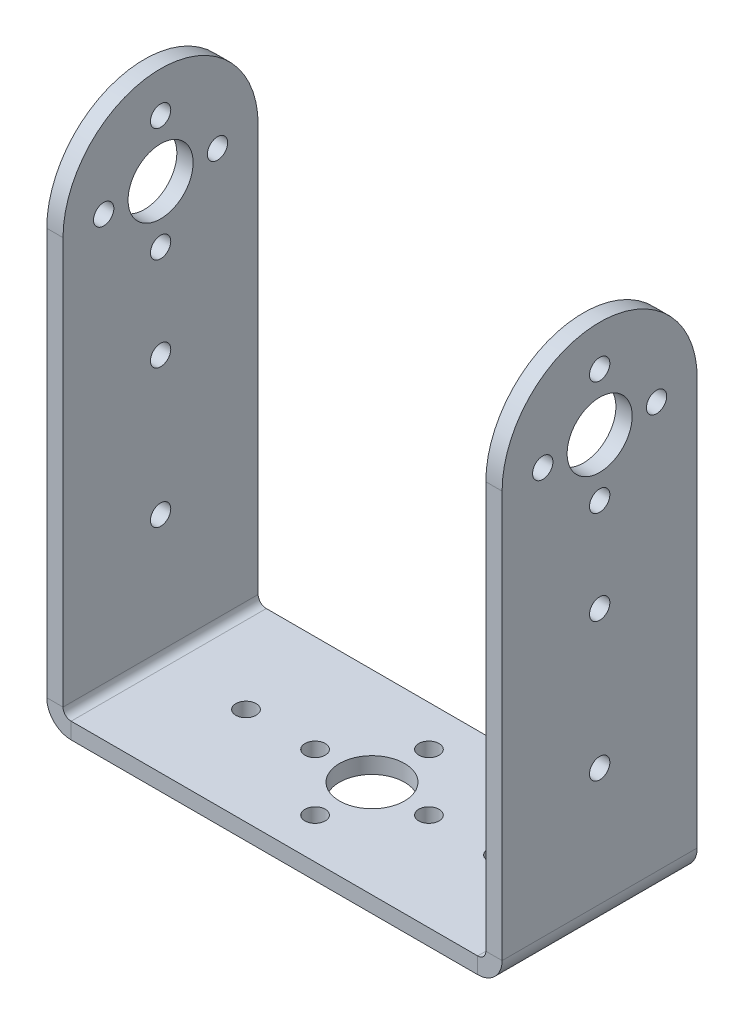
ISO-10303-21;
HEADER;
FILE_DESCRIPTION(('STEP AP214'),'2;1');
FILE_NAME('part.step','',(''),(''),'','','');
FILE_SCHEMA(('AUTOMOTIVE_DESIGN { 1 0 10303 214 1 1 1 1 }'));
ENDSEC;
DATA;
#1=APPLICATION_CONTEXT('core data for automotive mechanical design processes');
#2=APPLICATION_PROTOCOL_DEFINITION('international standard','automotive_design',2000,#1);
#3=PRODUCT_CONTEXT('',#1,'mechanical');
#4=PRODUCT('Part','Part','',(#3));
#5=PRODUCT_RELATED_PRODUCT_CATEGORY('part','',(#4));
#6=PRODUCT_DEFINITION_FORMATION('','',#4);
#7=PRODUCT_DEFINITION_CONTEXT('part definition',#1,'design');
#8=PRODUCT_DEFINITION('design','',#6,#7);
#9=PRODUCT_DEFINITION_SHAPE('','',#8);
#10=(LENGTH_UNIT() NAMED_UNIT(*) SI_UNIT(.MILLI.,.METRE.));
#11=(NAMED_UNIT(*) PLANE_ANGLE_UNIT() SI_UNIT($,.RADIAN.));
#12=(NAMED_UNIT(*) SI_UNIT($,.STERADIAN.) SOLID_ANGLE_UNIT());
#13=UNCERTAINTY_MEASURE_WITH_UNIT(LENGTH_MEASURE(1.E-05),#10,'distance_accuracy_value','');
#14=(GEOMETRIC_REPRESENTATION_CONTEXT(3) GLOBAL_UNCERTAINTY_ASSIGNED_CONTEXT((#13)) GLOBAL_UNIT_ASSIGNED_CONTEXT((#10,
#11,#12)) REPRESENTATION_CONTEXT('',''));
#15=CARTESIAN_POINT('',(0.,0.,0.));
#16=DIRECTION('',(0.,0.,1.));
#17=DIRECTION('',(1.,0.,0.));
#18=AXIS2_PLACEMENT_3D('',#15,#16,#17);
#19=CARTESIAN_POINT('',(28.,0.,12.));
#20=DIRECTION('',(-1.,0.,0.));
#21=DIRECTION('',(0.,-1.,0.));
#22=AXIS2_PLACEMENT_3D('',#19,#20,#21);
#23=PLANE('',#22);
#24=CARTESIAN_POINT('',(28.,60.,0.));
#25=DIRECTION('',(1.,0.,0.));
#26=DIRECTION('',(0.,0.,-1.));
#27=AXIS2_PLACEMENT_3D('',#24,#25,#26);
#28=CIRCLE('',#27,1.25);
#29=CARTESIAN_POINT('',(28.,60.,-1.25));
#30=VERTEX_POINT('',#29);
#31=EDGE_CURVE('E778',#30,#30,#28,.T.);
#32=ORIENTED_EDGE('',*,*,#31,.F.);
#33=EDGE_LOOP('',(#32));
#34=FACE_BOUND('',#33,.T.);
#35=CARTESIAN_POINT('',(28.,53.,-7.));
#36=DIRECTION('',(1.,0.,0.));
#37=DIRECTION('',(0.,0.,-1.));
#38=AXIS2_PLACEMENT_3D('',#35,#36,#37);
#39=CIRCLE('',#38,1.25);
#40=CARTESIAN_POINT('',(28.,53.,-8.25));
#41=VERTEX_POINT('',#40);
#42=EDGE_CURVE('E789',#41,#41,#39,.T.);
#43=ORIENTED_EDGE('',*,*,#42,.F.);
#44=EDGE_LOOP('',(#43));
#45=FACE_BOUND('',#44,.T.);
#46=CARTESIAN_POINT('',(28.,46.,0.));
#47=DIRECTION('',(1.,0.,0.));
#48=DIRECTION('',(0.,0.,-1.));
#49=AXIS2_PLACEMENT_3D('',#46,#47,#48);
#50=CIRCLE('',#49,1.25);
#51=CARTESIAN_POINT('',(28.,46.,-1.25));
#52=VERTEX_POINT('',#51);
#53=EDGE_CURVE('E801',#52,#52,#50,.T.);
#54=ORIENTED_EDGE('',*,*,#53,.F.);
#55=EDGE_LOOP('',(#54));
#56=FACE_BOUND('',#55,.T.);
#57=CARTESIAN_POINT('',(28.,34.5,0.));
#58=DIRECTION('',(1.,0.,0.));
#59=DIRECTION('',(0.,0.,-1.));
#60=AXIS2_PLACEMENT_3D('',#57,#58,#59);
#61=CIRCLE('',#60,1.25);
#62=CARTESIAN_POINT('',(28.,34.5,-1.25));
#63=VERTEX_POINT('',#62);
#64=EDGE_CURVE('E825',#63,#63,#61,.T.);
#65=ORIENTED_EDGE('',*,*,#64,.F.);
#66=EDGE_LOOP('',(#65));
#67=FACE_BOUND('',#66,.T.);
#68=CARTESIAN_POINT('',(28.,17.5,0.));
#69=DIRECTION('',(1.,0.,0.));
#70=DIRECTION('',(0.,0.,-1.));
#71=AXIS2_PLACEMENT_3D('',#68,#69,#70);
#72=CIRCLE('',#71,1.25);
#73=CARTESIAN_POINT('',(28.,17.5,-1.25));
#74=VERTEX_POINT('',#73);
#75=EDGE_CURVE('E837',#74,#74,#72,.T.);
#76=ORIENTED_EDGE('',*,*,#75,.F.);
#77=EDGE_LOOP('',(#76));
#78=FACE_BOUND('',#77,.T.);
#79=CARTESIAN_POINT('',(28.,53.,0.));
#80=DIRECTION('',(1.,0.,0.));
#81=DIRECTION('',(0.,0.,-1.));
#82=AXIS2_PLACEMENT_3D('',#79,#80,#81);
#83=CIRCLE('',#82,4.);
#84=CARTESIAN_POINT('',(28.,53.,-4.));
#85=VERTEX_POINT('',#84);
#86=EDGE_CURVE('E849',#85,#85,#83,.T.);
#87=ORIENTED_EDGE('',*,*,#86,.F.);
#88=EDGE_LOOP('',(#87));
#89=FACE_BOUND('',#88,.T.);
#90=DIRECTION('',(0.,1.,0.));
#91=VECTOR('',#90,1.);
#92=CARTESIAN_POINT('',(28.,0.,-12.));
#93=LINE('',#92,#91);
#94=CARTESIAN_POINT('',(28.,3.,-12.));
#95=VERTEX_POINT('',#94);
#96=CARTESIAN_POINT('',(28.,53.,-12.));
#97=VERTEX_POINT('',#96);
#98=EDGE_CURVE('E163',#95,#97,#93,.T.);
#99=ORIENTED_EDGE('',*,*,#98,.T.);
#100=CARTESIAN_POINT('',(28.,53.,0.));
#101=DIRECTION('',(-1.,0.,0.));
#102=DIRECTION('',(0.,-1.,0.));
#103=AXIS2_PLACEMENT_3D('',#100,#101,#102);
#104=CIRCLE('',#103,12.);
#105=CARTESIAN_POINT('',(28.,53.,12.));
#106=VERTEX_POINT('',#105);
#107=EDGE_CURVE('E256',#97,#106,#104,.F.);
#108=ORIENTED_EDGE('',*,*,#107,.T.);
#109=DIRECTION('',(0.,1.,0.));
#110=VECTOR('',#109,1.);
#111=CARTESIAN_POINT('',(28.,0.,12.));
#112=LINE('',#111,#110);
#113=CARTESIAN_POINT('',(28.,3.,12.));
#114=VERTEX_POINT('',#113);
#115=EDGE_CURVE('E188',#114,#106,#112,.T.);
#116=ORIENTED_EDGE('',*,*,#115,.F.);
#117=DIRECTION('',(0.,0.,-1.));
#118=VECTOR('',#117,1.);
#119=CARTESIAN_POINT('',(28.,3.,12.));
#120=LINE('',#119,#118);
#121=EDGE_CURVE('E162',#114,#95,#120,.T.);
#122=ORIENTED_EDGE('',*,*,#121,.T.);
#123=EDGE_LOOP('',(#99,#108,#116,#122));
#124=FACE_BOUND('',#123,.T.);
#125=CARTESIAN_POINT('',(28.,53.,7.));
#126=DIRECTION('',(1.,0.,0.));
#127=DIRECTION('',(0.,0.,-1.));
#128=AXIS2_PLACEMENT_3D('',#125,#126,#127);
#129=CIRCLE('',#128,1.25);
#130=CARTESIAN_POINT('',(28.,53.,5.75));
#131=VERTEX_POINT('',#130);
#132=EDGE_CURVE('E813',#131,#131,#129,.T.);
#133=ORIENTED_EDGE('',*,*,#132,.F.);
#134=EDGE_LOOP('',(#133));
#135=FACE_BOUND('',#134,.T.);
#136=ADVANCED_FACE('F39',(#34,#45,#56,#67,#78,#89,#124,#135),#23,.F.);
#137=CARTESIAN_POINT('',(26.,0.,12.));
#138=DIRECTION('',(-1.,0.,0.));
#139=DIRECTION('',(0.,-1.,0.));
#140=AXIS2_PLACEMENT_3D('',#137,#138,#139);
#141=PLANE('',#140);
#142=CARTESIAN_POINT('',(26.,60.,0.));
#143=DIRECTION('',(-1.,0.,0.));
#144=DIRECTION('',(0.,-1.,0.));
#145=AXIS2_PLACEMENT_3D('',#142,#143,#144);
#146=CIRCLE('',#145,1.25);
#147=CARTESIAN_POINT('',(26.,58.75,0.));
#148=VERTEX_POINT('',#147);
#149=EDGE_CURVE('E786',#148,#148,#146,.T.);
#150=ORIENTED_EDGE('',*,*,#149,.F.);
#151=EDGE_LOOP('',(#150));
#152=FACE_BOUND('',#151,.T.);
#153=CARTESIAN_POINT('',(26.,53.,-7.));
#154=DIRECTION('',(-1.,0.,0.));
#155=DIRECTION('',(0.,-1.,0.));
#156=AXIS2_PLACEMENT_3D('',#153,#154,#155);
#157=CIRCLE('',#156,1.25);
#158=CARTESIAN_POINT('',(26.,51.75,-7.));
#159=VERTEX_POINT('',#158);
#160=EDGE_CURVE('E798',#159,#159,#157,.T.);
#161=ORIENTED_EDGE('',*,*,#160,.F.);
#162=EDGE_LOOP('',(#161));
#163=FACE_BOUND('',#162,.T.);
#164=CARTESIAN_POINT('',(26.,46.,0.));
#165=DIRECTION('',(-1.,0.,0.));
#166=DIRECTION('',(0.,-1.,0.));
#167=AXIS2_PLACEMENT_3D('',#164,#165,#166);
#168=CIRCLE('',#167,1.25);
#169=CARTESIAN_POINT('',(26.,44.75,0.));
#170=VERTEX_POINT('',#169);
#171=EDGE_CURVE('E810',#170,#170,#168,.T.);
#172=ORIENTED_EDGE('',*,*,#171,.F.);
#173=EDGE_LOOP('',(#172));
#174=FACE_BOUND('',#173,.T.);
#175=CARTESIAN_POINT('',(26.,53.,7.));
#176=DIRECTION('',(-1.,0.,0.));
#177=DIRECTION('',(0.,-1.,0.));
#178=AXIS2_PLACEMENT_3D('',#175,#176,#177);
#179=CIRCLE('',#178,1.25);
#180=CARTESIAN_POINT('',(26.,51.75,7.));
#181=VERTEX_POINT('',#180);
#182=EDGE_CURVE('E822',#181,#181,#179,.T.);
#183=ORIENTED_EDGE('',*,*,#182,.F.);
#184=EDGE_LOOP('',(#183));
#185=FACE_BOUND('',#184,.T.);
#186=CARTESIAN_POINT('',(26.,34.5,0.));
#187=DIRECTION('',(-1.,0.,0.));
#188=DIRECTION('',(0.,-1.,0.));
#189=AXIS2_PLACEMENT_3D('',#186,#187,#188);
#190=CIRCLE('',#189,1.25);
#191=CARTESIAN_POINT('',(26.,33.25,0.));
#192=VERTEX_POINT('',#191);
#193=EDGE_CURVE('E834',#192,#192,#190,.T.);
#194=ORIENTED_EDGE('',*,*,#193,.F.);
#195=EDGE_LOOP('',(#194));
#196=FACE_BOUND('',#195,.T.);
#197=CARTESIAN_POINT('',(26.,17.5,0.));
#198=DIRECTION('',(-1.,0.,0.));
#199=DIRECTION('',(0.,-1.,0.));
#200=AXIS2_PLACEMENT_3D('',#197,#198,#199);
#201=CIRCLE('',#200,1.25);
#202=CARTESIAN_POINT('',(26.,16.25,0.));
#203=VERTEX_POINT('',#202);
#204=EDGE_CURVE('E843',#203,#203,#201,.T.);
#205=ORIENTED_EDGE('',*,*,#204,.F.);
#206=EDGE_LOOP('',(#205));
#207=FACE_BOUND('',#206,.T.);
#208=CARTESIAN_POINT('',(26.,53.,0.));
#209=DIRECTION('',(-1.,0.,0.));
#210=DIRECTION('',(0.,-1.,0.));
#211=AXIS2_PLACEMENT_3D('',#208,#209,#210);
#212=CIRCLE('',#211,4.);
#213=CARTESIAN_POINT('',(26.,49.,0.));
#214=VERTEX_POINT('',#213);
#215=EDGE_CURVE('E254',#214,#214,#212,.T.);
#216=ORIENTED_EDGE('',*,*,#215,.F.);
#217=EDGE_LOOP('',(#216));
#218=FACE_BOUND('',#217,.T.);
#219=CARTESIAN_POINT('',(26.,53.,0.));
#220=DIRECTION('',(-1.,0.,0.));
#221=DIRECTION('',(0.,-1.,0.));
#222=AXIS2_PLACEMENT_3D('',#219,#220,#221);
#223=CIRCLE('',#222,12.);
#224=CARTESIAN_POINT('',(26.,53.,-12.));
#225=VERTEX_POINT('',#224);
#226=CARTESIAN_POINT('',(26.,53.,12.));
#227=VERTEX_POINT('',#226);
#228=EDGE_CURVE('E259',#225,#227,#223,.F.);
#229=ORIENTED_EDGE('',*,*,#228,.F.);
#230=DIRECTION('',(0.,1.,0.));
#231=VECTOR('',#230,1.);
#232=CARTESIAN_POINT('',(26.,0.,-12.));
#233=LINE('',#232,#231);
#234=CARTESIAN_POINT('',(26.,3.,-12.));
#235=VERTEX_POINT('',#234);
#236=EDGE_CURVE('E166',#235,#225,#233,.T.);
#237=ORIENTED_EDGE('',*,*,#236,.F.);
#238=DIRECTION('',(0.,0.,-1.));
#239=VECTOR('',#238,1.);
#240=CARTESIAN_POINT('',(26.,3.,12.));
#241=LINE('',#240,#239);
#242=CARTESIAN_POINT('',(26.,3.,12.));
#243=VERTEX_POINT('',#242);
#244=EDGE_CURVE('E200',#243,#235,#241,.T.);
#245=ORIENTED_EDGE('',*,*,#244,.F.);
#246=DIRECTION('',(0.,1.,0.));
#247=VECTOR('',#246,1.);
#248=CARTESIAN_POINT('',(26.,0.,12.));
#249=LINE('',#248,#247);
#250=EDGE_CURVE('E275',#243,#227,#249,.T.);
#251=ORIENTED_EDGE('',*,*,#250,.T.);
#252=EDGE_LOOP('',(#229,#237,#245,#251));
#253=FACE_BOUND('',#252,.T.);
#254=ADVANCED_FACE('F312',(#152,#163,#174,#185,#196,#207,#218,#253),#141,.T.);
#255=CARTESIAN_POINT('',(-26.,65.,12.));
#256=DIRECTION('',(1.,0.,0.));
#257=DIRECTION('',(0.,1.,0.));
#258=AXIS2_PLACEMENT_3D('',#255,#256,#257);
#259=PLANE('',#258);
#260=CARTESIAN_POINT('',(-26.,60.,0.));
#261=DIRECTION('',(1.,0.,0.));
#262=DIRECTION('',(0.,1.,0.));
#263=AXIS2_PLACEMENT_3D('',#260,#261,#262);
#264=CIRCLE('',#263,1.25);
#265=CARTESIAN_POINT('',(-26.,61.25,0.));
#266=VERTEX_POINT('',#265);
#267=EDGE_CURVE('E783',#266,#266,#264,.T.);
#268=ORIENTED_EDGE('',*,*,#267,.F.);
#269=EDGE_LOOP('',(#268));
#270=FACE_BOUND('',#269,.T.);
#271=CARTESIAN_POINT('',(-26.,53.,-7.));
#272=DIRECTION('',(1.,0.,0.));
#273=DIRECTION('',(0.,1.,0.));
#274=AXIS2_PLACEMENT_3D('',#271,#272,#273);
#275=CIRCLE('',#274,1.25);
#276=CARTESIAN_POINT('',(-26.,54.25,-7.));
#277=VERTEX_POINT('',#276);
#278=EDGE_CURVE('E795',#277,#277,#275,.T.);
#279=ORIENTED_EDGE('',*,*,#278,.F.);
#280=EDGE_LOOP('',(#279));
#281=FACE_BOUND('',#280,.T.);
#282=CARTESIAN_POINT('',(-26.,46.,0.));
#283=DIRECTION('',(1.,0.,0.));
#284=DIRECTION('',(0.,1.,0.));
#285=AXIS2_PLACEMENT_3D('',#282,#283,#284);
#286=CIRCLE('',#285,1.25);
#287=CARTESIAN_POINT('',(-26.,47.25,0.));
#288=VERTEX_POINT('',#287);
#289=EDGE_CURVE('E807',#288,#288,#286,.T.);
#290=ORIENTED_EDGE('',*,*,#289,.F.);
#291=EDGE_LOOP('',(#290));
#292=FACE_BOUND('',#291,.T.);
#293=CARTESIAN_POINT('',(-26.,53.,7.));
#294=DIRECTION('',(1.,0.,0.));
#295=DIRECTION('',(0.,1.,0.));
#296=AXIS2_PLACEMENT_3D('',#293,#294,#295);
#297=CIRCLE('',#296,1.25);
#298=CARTESIAN_POINT('',(-26.,54.25,7.));
#299=VERTEX_POINT('',#298);
#300=EDGE_CURVE('E819',#299,#299,#297,.T.);
#301=ORIENTED_EDGE('',*,*,#300,.F.);
#302=EDGE_LOOP('',(#301));
#303=FACE_BOUND('',#302,.T.);
#304=CARTESIAN_POINT('',(-26.,34.5,0.));
#305=DIRECTION('',(1.,0.,0.));
#306=DIRECTION('',(0.,1.,0.));
#307=AXIS2_PLACEMENT_3D('',#304,#305,#306);
#308=CIRCLE('',#307,1.25);
#309=CARTESIAN_POINT('',(-26.,35.75,0.));
#310=VERTEX_POINT('',#309);
#311=EDGE_CURVE('E831',#310,#310,#308,.T.);
#312=ORIENTED_EDGE('',*,*,#311,.F.);
#313=EDGE_LOOP('',(#312));
#314=FACE_BOUND('',#313,.T.);
#315=CARTESIAN_POINT('',(-26.,17.5,0.));
#316=DIRECTION('',(1.,0.,0.));
#317=DIRECTION('',(0.,1.,0.));
#318=AXIS2_PLACEMENT_3D('',#315,#316,#317);
#319=CIRCLE('',#318,1.25);
#320=CARTESIAN_POINT('',(-26.,18.75,0.));
#321=VERTEX_POINT('',#320);
#322=EDGE_CURVE('E846',#321,#321,#319,.T.);
#323=ORIENTED_EDGE('',*,*,#322,.F.);
#324=EDGE_LOOP('',(#323));
#325=FACE_BOUND('',#324,.T.);
#326=CARTESIAN_POINT('',(-26.,53.,0.));
#327=DIRECTION('',(1.,0.,0.));
#328=DIRECTION('',(0.,1.,0.));
#329=AXIS2_PLACEMENT_3D('',#326,#327,#328);
#330=CIRCLE('',#329,4.);
#331=CARTESIAN_POINT('',(-26.,57.,0.));
#332=VERTEX_POINT('',#331);
#333=EDGE_CURVE('E855',#332,#332,#330,.T.);
#334=ORIENTED_EDGE('',*,*,#333,.F.);
#335=EDGE_LOOP('',(#334));
#336=FACE_BOUND('',#335,.T.);
#337=DIRECTION('',(0.,-1.,0.));
#338=VECTOR('',#337,1.);
#339=CARTESIAN_POINT('',(-26.,65.,-12.));
#340=LINE('',#339,#338);
#341=CARTESIAN_POINT('',(-26.,53.,-12.));
#342=VERTEX_POINT('',#341);
#343=CARTESIAN_POINT('',(-26.,3.,-12.));
#344=VERTEX_POINT('',#343);
#345=EDGE_CURVE('E178',#342,#344,#340,.T.);
#346=ORIENTED_EDGE('',*,*,#345,.F.);
#347=CARTESIAN_POINT('',(-26.,53.,0.));
#348=DIRECTION('',(1.,0.,0.));
#349=DIRECTION('',(0.,1.,0.));
#350=AXIS2_PLACEMENT_3D('',#347,#348,#349);
#351=CIRCLE('',#350,12.);
#352=CARTESIAN_POINT('',(-26.,53.,12.));
#353=VERTEX_POINT('',#352);
#354=EDGE_CURVE('E266',#353,#342,#351,.F.);
#355=ORIENTED_EDGE('',*,*,#354,.F.);
#356=DIRECTION('',(0.,-1.,0.));
#357=VECTOR('',#356,1.);
#358=CARTESIAN_POINT('',(-26.,65.,12.));
#359=LINE('',#358,#357);
#360=CARTESIAN_POINT('',(-26.,3.,12.));
#361=VERTEX_POINT('',#360);
#362=EDGE_CURVE('E157',#353,#361,#359,.T.);
#363=ORIENTED_EDGE('',*,*,#362,.T.);
#364=DIRECTION('',(0.,0.,-1.));
#365=VECTOR('',#364,1.);
#366=CARTESIAN_POINT('',(-26.,3.,12.));
#367=LINE('',#366,#365);
#368=EDGE_CURVE('E193',#361,#344,#367,.T.);
#369=ORIENTED_EDGE('',*,*,#368,.T.);
#370=EDGE_LOOP('',(#346,#355,#363,#369));
#371=FACE_BOUND('',#370,.T.);
#372=ADVANCED_FACE('F283',(#270,#281,#292,#303,#314,#325,#336,#371),#259,.T.);
#373=CARTESIAN_POINT('',(-28.,65.,12.));
#374=DIRECTION('',(1.,0.,0.));
#375=DIRECTION('',(0.,1.,0.));
#376=AXIS2_PLACEMENT_3D('',#373,#374,#375);
#377=PLANE('',#376);
#378=CARTESIAN_POINT('',(-28.,60.,0.));
#379=DIRECTION('',(1.,0.,0.));
#380=DIRECTION('',(0.,0.,-1.));
#381=AXIS2_PLACEMENT_3D('',#378,#379,#380);
#382=CIRCLE('',#381,1.24999999999999);
#383=CARTESIAN_POINT('',(-28.,60.,-1.24999999999999));
#384=VERTEX_POINT('',#383);
#385=EDGE_CURVE('E781',#384,#384,#382,.T.);
#386=ORIENTED_EDGE('',*,*,#385,.T.);
#387=EDGE_LOOP('',(#386));
#388=FACE_BOUND('',#387,.T.);
#389=CARTESIAN_POINT('',(-28.,53.,-7.));
#390=DIRECTION('',(1.,0.,0.));
#391=DIRECTION('',(0.,0.,-1.));
#392=AXIS2_PLACEMENT_3D('',#389,#390,#391);
#393=CIRCLE('',#392,1.24999999999999);
#394=CARTESIAN_POINT('',(-28.,53.,-8.24999999999999));
#395=VERTEX_POINT('',#394);
#396=EDGE_CURVE('E792',#395,#395,#393,.T.);
#397=ORIENTED_EDGE('',*,*,#396,.T.);
#398=EDGE_LOOP('',(#397));
#399=FACE_BOUND('',#398,.T.);
#400=CARTESIAN_POINT('',(-28.,46.,0.));
#401=DIRECTION('',(1.,0.,0.));
#402=DIRECTION('',(0.,0.,-1.));
#403=AXIS2_PLACEMENT_3D('',#400,#401,#402);
#404=CIRCLE('',#403,1.24999999999999);
#405=CARTESIAN_POINT('',(-28.,46.,-1.24999999999999));
#406=VERTEX_POINT('',#405);
#407=EDGE_CURVE('E804',#406,#406,#404,.T.);
#408=ORIENTED_EDGE('',*,*,#407,.T.);
#409=EDGE_LOOP('',(#408));
#410=FACE_BOUND('',#409,.T.);
#411=CARTESIAN_POINT('',(-28.,53.,7.));
#412=DIRECTION('',(1.,0.,0.));
#413=DIRECTION('',(0.,0.,-1.));
#414=AXIS2_PLACEMENT_3D('',#411,#412,#413);
#415=CIRCLE('',#414,1.24999999999999);
#416=CARTESIAN_POINT('',(-28.,53.,5.75000000000001));
#417=VERTEX_POINT('',#416);
#418=EDGE_CURVE('E816',#417,#417,#415,.T.);
#419=ORIENTED_EDGE('',*,*,#418,.T.);
#420=EDGE_LOOP('',(#419));
#421=FACE_BOUND('',#420,.T.);
#422=CARTESIAN_POINT('',(-28.,34.5,0.));
#423=DIRECTION('',(1.,0.,0.));
#424=DIRECTION('',(0.,0.,-1.));
#425=AXIS2_PLACEMENT_3D('',#422,#423,#424);
#426=CIRCLE('',#425,1.24999999999999);
#427=CARTESIAN_POINT('',(-28.,34.5,-1.24999999999999));
#428=VERTEX_POINT('',#427);
#429=EDGE_CURVE('E828',#428,#428,#426,.T.);
#430=ORIENTED_EDGE('',*,*,#429,.T.);
#431=EDGE_LOOP('',(#430));
#432=FACE_BOUND('',#431,.T.);
#433=CARTESIAN_POINT('',(-28.,17.5,0.));
#434=DIRECTION('',(1.,0.,0.));
#435=DIRECTION('',(0.,0.,-1.));
#436=AXIS2_PLACEMENT_3D('',#433,#434,#435);
#437=CIRCLE('',#436,1.24999999999999);
#438=CARTESIAN_POINT('',(-28.,17.5,-1.24999999999999));
#439=VERTEX_POINT('',#438);
#440=EDGE_CURVE('E840',#439,#439,#437,.T.);
#441=ORIENTED_EDGE('',*,*,#440,.T.);
#442=EDGE_LOOP('',(#441));
#443=FACE_BOUND('',#442,.T.);
#444=CARTESIAN_POINT('',(-28.,53.,0.));
#445=DIRECTION('',(1.,0.,0.));
#446=DIRECTION('',(0.,0.,-1.));
#447=AXIS2_PLACEMENT_3D('',#444,#445,#446);
#448=CIRCLE('',#447,4.);
#449=CARTESIAN_POINT('',(-28.,53.,-4.));
#450=VERTEX_POINT('',#449);
#451=EDGE_CURVE('E852',#450,#450,#448,.T.);
#452=ORIENTED_EDGE('',*,*,#451,.T.);
#453=EDGE_LOOP('',(#452));
#454=FACE_BOUND('',#453,.T.);
#455=CARTESIAN_POINT('',(-28.,53.,0.));
#456=DIRECTION('',(1.,0.,0.));
#457=DIRECTION('',(0.,1.,0.));
#458=AXIS2_PLACEMENT_3D('',#455,#456,#457);
#459=CIRCLE('',#458,12.);
#460=CARTESIAN_POINT('',(-28.,53.,12.));
#461=VERTEX_POINT('',#460);
#462=CARTESIAN_POINT('',(-28.,53.,-12.));
#463=VERTEX_POINT('',#462);
#464=EDGE_CURVE('E267',#461,#463,#459,.F.);
#465=ORIENTED_EDGE('',*,*,#464,.T.);
#466=DIRECTION('',(0.,-1.,0.));
#467=VECTOR('',#466,1.);
#468=CARTESIAN_POINT('',(-28.,65.,-12.));
#469=LINE('',#468,#467);
#470=CARTESIAN_POINT('',(-28.,3.,-12.));
#471=VERTEX_POINT('',#470);
#472=EDGE_CURVE('E181',#463,#471,#469,.T.);
#473=ORIENTED_EDGE('',*,*,#472,.T.);
#474=DIRECTION('',(0.,0.,-1.));
#475=VECTOR('',#474,1.);
#476=CARTESIAN_POINT('',(-28.,3.,12.));
#477=LINE('',#476,#475);
#478=CARTESIAN_POINT('',(-28.,3.,12.));
#479=VERTEX_POINT('',#478);
#480=EDGE_CURVE('E136',#479,#471,#477,.T.);
#481=ORIENTED_EDGE('',*,*,#480,.F.);
#482=DIRECTION('',(0.,-1.,0.));
#483=VECTOR('',#482,1.);
#484=CARTESIAN_POINT('',(-28.,65.,12.));
#485=LINE('',#484,#483);
#486=EDGE_CURVE('E155',#461,#479,#485,.T.);
#487=ORIENTED_EDGE('',*,*,#486,.F.);
#488=EDGE_LOOP('',(#465,#473,#481,#487));
#489=FACE_BOUND('',#488,.T.);
#490=ADVANCED_FACE('F302',(#388,#399,#410,#421,#432,#443,#454,#489),#377,.F.);
#491=CARTESIAN_POINT('',(25.,3.,12.));
#492=DIRECTION('',(0.,0.,1.));
#493=DIRECTION('',(1.,0.,0.));
#494=AXIS2_PLACEMENT_3D('',#491,#492,#493);
#495=PLANE('',#494);
#496=ORIENTED_EDGE('',*,*,#115,.T.);
#497=DIRECTION('',(1.,0.,0.));
#498=VECTOR('',#497,1.);
#499=CARTESIAN_POINT('',(28.,53.,12.));
#500=LINE('',#499,#498);
#501=EDGE_CURVE('E54',#106,#227,#500,.F.);
#502=ORIENTED_EDGE('',*,*,#501,.T.);
#503=ORIENTED_EDGE('',*,*,#250,.F.);
#504=DIRECTION('',(1.,0.,0.));
#505=VECTOR('',#504,1.);
#506=CARTESIAN_POINT('',(26.,3.,12.));
#507=LINE('',#506,#505);
#508=EDGE_CURVE('E208',#243,#114,#507,.T.);
#509=ORIENTED_EDGE('',*,*,#508,.T.);
#510=EDGE_LOOP('',(#496,#502,#503,#509));
#511=FACE_BOUND('',#510,.T.);
#512=ADVANCED_FACE('F304',(#511),#495,.T.);
#513=CARTESIAN_POINT('',(-28.,3.,12.));
#514=DIRECTION('',(0.,0.,1.));
#515=DIRECTION('',(1.,0.,0.));
#516=AXIS2_PLACEMENT_3D('',#513,#514,#515);
#517=PLANE('',#516);
#518=DIRECTION('',(1.,0.,0.));
#519=VECTOR('',#518,1.);
#520=CARTESIAN_POINT('',(-28.,3.,12.));
#521=LINE('',#520,#519);
#522=EDGE_CURVE('E11',#479,#361,#521,.T.);
#523=ORIENTED_EDGE('',*,*,#522,.F.);
#524=CARTESIAN_POINT('',(-25.,3.,12.));
#525=DIRECTION('',(0.,0.,-1.));
#526=DIRECTION('',(-1.,0.,0.));
#527=AXIS2_PLACEMENT_3D('',#524,#525,#526);
#528=CIRCLE('',#527,3.);
#529=CARTESIAN_POINT('',(-25.,0.,12.));
#530=VERTEX_POINT('',#529);
#531=EDGE_CURVE('E128',#479,#530,#528,.F.);
#532=ORIENTED_EDGE('',*,*,#531,.T.);
#533=DIRECTION('',(0.,-1.,0.));
#534=VECTOR('',#533,1.);
#535=CARTESIAN_POINT('',(-25.,2.,12.));
#536=LINE('',#535,#534);
#537=CARTESIAN_POINT('',(-25.,2.,12.));
#538=VERTEX_POINT('',#537);
#539=EDGE_CURVE('E47',#538,#530,#536,.T.);
#540=ORIENTED_EDGE('',*,*,#539,.F.);
#541=CARTESIAN_POINT('',(-25.,3.,12.));
#542=DIRECTION('',(0.,0.,1.));
#543=DIRECTION('',(1.,0.,0.));
#544=AXIS2_PLACEMENT_3D('',#541,#542,#543);
#545=CIRCLE('',#544,1.);
#546=EDGE_CURVE('E225',#361,#538,#545,.T.);
#547=ORIENTED_EDGE('',*,*,#546,.F.);
#548=EDGE_LOOP('',(#523,#532,#540,#547));
#549=FACE_BOUND('',#548,.T.);
#550=ADVANCED_FACE('F41',(#549),#517,.T.);
#551=CARTESIAN_POINT('',(-25.,2.,12.));
#552=DIRECTION('',(0.,0.,1.));
#553=DIRECTION('',(1.,0.,0.));
#554=AXIS2_PLACEMENT_3D('',#551,#552,#553);
#555=PLANE('',#554);
#556=DIRECTION('',(1.,0.,0.));
#557=VECTOR('',#556,1.);
#558=CARTESIAN_POINT('',(-26.,53.,12.));
#559=LINE('',#558,#557);
#560=EDGE_CURVE('E167',#353,#461,#559,.F.);
#561=ORIENTED_EDGE('',*,*,#560,.T.);
#562=ORIENTED_EDGE('',*,*,#486,.T.);
#563=ORIENTED_EDGE('',*,*,#522,.T.);
#564=ORIENTED_EDGE('',*,*,#362,.F.);
#565=EDGE_LOOP('',(#561,#562,#563,#564));
#566=FACE_BOUND('',#565,.T.);
#567=ADVANCED_FACE('F285',(#566),#555,.T.);
#568=CARTESIAN_POINT('',(-25.,0.,-12.));
#569=DIRECTION('',(0.,0.,-1.));
#570=DIRECTION('',(-1.,0.,0.));
#571=AXIS2_PLACEMENT_3D('',#568,#569,#570);
#572=PLANE('',#571);
#573=DIRECTION('',(0.,1.,0.));
#574=VECTOR('',#573,1.);
#575=CARTESIAN_POINT('',(-25.,0.,-12.));
#576=LINE('',#575,#574);
#577=CARTESIAN_POINT('',(-25.,0.,-12.));
#578=VERTEX_POINT('',#577);
#579=CARTESIAN_POINT('',(-25.,2.,-12.));
#580=VERTEX_POINT('',#579);
#581=EDGE_CURVE('E153',#578,#580,#576,.T.);
#582=ORIENTED_EDGE('',*,*,#581,.F.);
#583=CARTESIAN_POINT('',(-25.,3.,-12.));
#584=DIRECTION('',(0.,0.,-1.));
#585=DIRECTION('',(-1.,0.,0.));
#586=AXIS2_PLACEMENT_3D('',#583,#584,#585);
#587=CIRCLE('',#586,3.);
#588=EDGE_CURVE('E131',#471,#578,#587,.F.);
#589=ORIENTED_EDGE('',*,*,#588,.F.);
#590=DIRECTION('',(-1.,0.,0.));
#591=VECTOR('',#590,1.);
#592=CARTESIAN_POINT('',(-26.,3.,-12.));
#593=LINE('',#592,#591);
#594=EDGE_CURVE('E212',#344,#471,#593,.T.);
#595=ORIENTED_EDGE('',*,*,#594,.F.);
#596=CARTESIAN_POINT('',(-25.,3.,-12.));
#597=DIRECTION('',(0.,0.,1.));
#598=DIRECTION('',(1.,0.,0.));
#599=AXIS2_PLACEMENT_3D('',#596,#597,#598);
#600=CIRCLE('',#599,1.);
#601=EDGE_CURVE('E175',#344,#580,#600,.T.);
#602=ORIENTED_EDGE('',*,*,#601,.T.);
#603=EDGE_LOOP('',(#582,#589,#595,#602));
#604=FACE_BOUND('',#603,.T.);
#605=ADVANCED_FACE('F219',(#604),#572,.T.);
#606=CARTESIAN_POINT('',(-26.,3.,-12.));
#607=DIRECTION('',(0.,0.,-1.));
#608=DIRECTION('',(-1.,0.,0.));
#609=AXIS2_PLACEMENT_3D('',#606,#607,#608);
#610=PLANE('',#609);
#611=DIRECTION('',(1.,0.,0.));
#612=VECTOR('',#611,1.);
#613=CARTESIAN_POINT('',(-28.,0.,-12.));
#614=LINE('',#613,#612);
#615=CARTESIAN_POINT('',(25.,0.,-12.));
#616=VERTEX_POINT('',#615);
#617=EDGE_CURVE('E185',#578,#616,#614,.T.);
#618=ORIENTED_EDGE('',*,*,#617,.F.);
#619=ORIENTED_EDGE('',*,*,#581,.T.);
#620=DIRECTION('',(1.,0.,0.));
#621=VECTOR('',#620,1.);
#622=CARTESIAN_POINT('',(-28.,2.,-12.));
#623=LINE('',#622,#621);
#624=CARTESIAN_POINT('',(25.,2.,-12.));
#625=VERTEX_POINT('',#624);
#626=EDGE_CURVE('E172',#580,#625,#623,.T.);
#627=ORIENTED_EDGE('',*,*,#626,.T.);
#628=DIRECTION('',(0.,-1.,0.));
#629=VECTOR('',#628,1.);
#630=CARTESIAN_POINT('',(25.,2.,-12.));
#631=LINE('',#630,#629);
#632=EDGE_CURVE('E202',#625,#616,#631,.T.);
#633=ORIENTED_EDGE('',*,*,#632,.T.);
#634=EDGE_LOOP('',(#618,#619,#627,#633));
#635=FACE_BOUND('',#634,.T.);
#636=ADVANCED_FACE('F216',(#635),#610,.T.);
#637=CARTESIAN_POINT('',(25.,0.,12.));
#638=DIRECTION('',(0.,0.,1.));
#639=DIRECTION('',(1.,0.,0.));
#640=AXIS2_PLACEMENT_3D('',#637,#638,#639);
#641=PLANE('',#640);
#642=DIRECTION('',(0.,1.,0.));
#643=VECTOR('',#642,1.);
#644=CARTESIAN_POINT('',(25.,0.,12.));
#645=LINE('',#644,#643);
#646=CARTESIAN_POINT('',(25.,0.,12.));
#647=VERTEX_POINT('',#646);
#648=CARTESIAN_POINT('',(25.,2.,12.));
#649=VERTEX_POINT('',#648);
#650=EDGE_CURVE('E210',#647,#649,#645,.T.);
#651=ORIENTED_EDGE('',*,*,#650,.F.);
#652=CARTESIAN_POINT('',(25.,3.,12.));
#653=DIRECTION('',(0.,0.,-1.));
#654=DIRECTION('',(-1.,0.,0.));
#655=AXIS2_PLACEMENT_3D('',#652,#653,#654);
#656=CIRCLE('',#655,3.);
#657=EDGE_CURVE('E63',#647,#114,#656,.F.);
#658=ORIENTED_EDGE('',*,*,#657,.T.);
#659=ORIENTED_EDGE('',*,*,#508,.F.);
#660=CARTESIAN_POINT('',(25.,3.,12.));
#661=DIRECTION('',(0.,0.,1.));
#662=DIRECTION('',(1.,0.,0.));
#663=AXIS2_PLACEMENT_3D('',#660,#661,#662);
#664=CIRCLE('',#663,1.);
#665=EDGE_CURVE('E106',#649,#243,#664,.T.);
#666=ORIENTED_EDGE('',*,*,#665,.F.);
#667=EDGE_LOOP('',(#651,#658,#659,#666));
#668=FACE_BOUND('',#667,.T.);
#669=ADVANCED_FACE('F336',(#668),#641,.T.);
#670=CARTESIAN_POINT('',(26.,3.,12.));
#671=DIRECTION('',(0.,0.,1.));
#672=DIRECTION('',(1.,0.,0.));
#673=AXIS2_PLACEMENT_3D('',#670,#671,#672);
#674=PLANE('',#673);
#675=DIRECTION('',(1.,0.,0.));
#676=VECTOR('',#675,1.);
#677=CARTESIAN_POINT('',(-28.,0.,12.));
#678=LINE('',#677,#676);
#679=EDGE_CURVE('E140',#530,#647,#678,.T.);
#680=ORIENTED_EDGE('',*,*,#679,.T.);
#681=ORIENTED_EDGE('',*,*,#650,.T.);
#682=DIRECTION('',(1.,0.,0.));
#683=VECTOR('',#682,1.);
#684=CARTESIAN_POINT('',(-28.,2.,12.));
#685=LINE('',#684,#683);
#686=EDGE_CURVE('E150',#538,#649,#685,.T.);
#687=ORIENTED_EDGE('',*,*,#686,.F.);
#688=ORIENTED_EDGE('',*,*,#539,.T.);
#689=EDGE_LOOP('',(#680,#681,#687,#688));
#690=FACE_BOUND('',#689,.T.);
#691=ADVANCED_FACE('F148',(#690),#674,.T.);
#692=CARTESIAN_POINT('',(28.,3.,-12.));
#693=DIRECTION('',(0.,0.,-1.));
#694=DIRECTION('',(-1.,0.,0.));
#695=AXIS2_PLACEMENT_3D('',#692,#693,#694);
#696=PLANE('',#695);
#697=DIRECTION('',(-1.,0.,0.));
#698=VECTOR('',#697,1.);
#699=CARTESIAN_POINT('',(28.,3.,-12.));
#700=LINE('',#699,#698);
#701=EDGE_CURVE('E205',#95,#235,#700,.T.);
#702=ORIENTED_EDGE('',*,*,#701,.F.);
#703=CARTESIAN_POINT('',(25.,3.,-12.));
#704=DIRECTION('',(0.,0.,-1.));
#705=DIRECTION('',(-1.,0.,0.));
#706=AXIS2_PLACEMENT_3D('',#703,#704,#705);
#707=CIRCLE('',#706,3.);
#708=EDGE_CURVE('E97',#616,#95,#707,.F.);
#709=ORIENTED_EDGE('',*,*,#708,.F.);
#710=ORIENTED_EDGE('',*,*,#632,.F.);
#711=CARTESIAN_POINT('',(25.,3.,-12.));
#712=DIRECTION('',(0.,0.,1.));
#713=DIRECTION('',(1.,0.,0.));
#714=AXIS2_PLACEMENT_3D('',#711,#712,#713);
#715=CIRCLE('',#714,1.);
#716=EDGE_CURVE('E170',#625,#235,#715,.T.);
#717=ORIENTED_EDGE('',*,*,#716,.T.);
#718=EDGE_LOOP('',(#702,#709,#710,#717));
#719=FACE_BOUND('',#718,.T.);
#720=ADVANCED_FACE('F234',(#719),#696,.T.);
#721=CARTESIAN_POINT('',(25.,2.,-12.));
#722=DIRECTION('',(0.,0.,-1.));
#723=DIRECTION('',(-1.,0.,0.));
#724=AXIS2_PLACEMENT_3D('',#721,#722,#723);
#725=PLANE('',#724);
#726=DIRECTION('',(-1.,0.,0.));
#727=VECTOR('',#726,1.);
#728=CARTESIAN_POINT('',(26.,53.,-12.));
#729=LINE('',#728,#727);
#730=EDGE_CURVE('E245',#225,#97,#729,.F.);
#731=ORIENTED_EDGE('',*,*,#730,.T.);
#732=ORIENTED_EDGE('',*,*,#98,.F.);
#733=ORIENTED_EDGE('',*,*,#701,.T.);
#734=ORIENTED_EDGE('',*,*,#236,.T.);
#735=EDGE_LOOP('',(#731,#732,#733,#734));
#736=FACE_BOUND('',#735,.T.);
#737=ADVANCED_FACE('F243',(#736),#725,.T.);
#738=CARTESIAN_POINT('',(25.,3.,12.));
#739=DIRECTION('',(0.,0.,-1.));
#740=DIRECTION('',(-1.,0.,0.));
#741=AXIS2_PLACEMENT_3D('',#738,#739,#740);
#742=CYLINDRICAL_SURFACE('',#741,1.);
#743=ORIENTED_EDGE('',*,*,#716,.F.);
#744=DIRECTION('',(0.,0.,-1.));
#745=VECTOR('',#744,1.);
#746=CARTESIAN_POINT('',(25.,2.,12.));
#747=LINE('',#746,#745);
#748=EDGE_CURVE('E198',#649,#625,#747,.T.);
#749=ORIENTED_EDGE('',*,*,#748,.F.);
#750=ORIENTED_EDGE('',*,*,#665,.T.);
#751=ORIENTED_EDGE('',*,*,#244,.T.);
#752=EDGE_LOOP('',(#743,#749,#750,#751));
#753=FACE_BOUND('',#752,.T.);
#754=ADVANCED_FACE('F230',(#753),#742,.F.);
#755=CARTESIAN_POINT('',(-28.,2.,12.));
#756=DIRECTION('',(0.,1.,0.));
#757=DIRECTION('',(0.,0.,1.));
#758=AXIS2_PLACEMENT_3D('',#755,#756,#757);
#759=PLANE('',#758);
#760=CARTESIAN_POINT('',(0.,2.,-7.));
#761=DIRECTION('',(0.,1.,0.));
#762=DIRECTION('',(0.,0.,1.));
#763=AXIS2_PLACEMENT_3D('',#760,#761,#762);
#764=CIRCLE('',#763,1.25);
#765=CARTESIAN_POINT('',(0.,2.,-5.75));
#766=VERTEX_POINT('',#765);
#767=EDGE_CURVE('E738',#766,#766,#764,.T.);
#768=ORIENTED_EDGE('',*,*,#767,.F.);
#769=EDGE_LOOP('',(#768));
#770=FACE_BOUND('',#769,.T.);
#771=CARTESIAN_POINT('',(7.,2.,0.));
#772=DIRECTION('',(0.,1.,0.));
#773=DIRECTION('',(0.,0.,1.));
#774=AXIS2_PLACEMENT_3D('',#771,#772,#773);
#775=CIRCLE('',#774,1.25);
#776=CARTESIAN_POINT('',(7.,2.,1.25));
#777=VERTEX_POINT('',#776);
#778=EDGE_CURVE('E740',#777,#777,#775,.T.);
#779=ORIENTED_EDGE('',*,*,#778,.F.);
#780=EDGE_LOOP('',(#779));
#781=FACE_BOUND('',#780,.T.);
#782=CARTESIAN_POINT('',(0.,2.,7.));
#783=DIRECTION('',(0.,1.,0.));
#784=DIRECTION('',(0.,0.,1.));
#785=AXIS2_PLACEMENT_3D('',#782,#783,#784);
#786=CIRCLE('',#785,1.25);
#787=CARTESIAN_POINT('',(0.,2.,8.25));
#788=VERTEX_POINT('',#787);
#789=EDGE_CURVE('E748',#788,#788,#786,.T.);
#790=ORIENTED_EDGE('',*,*,#789,.F.);
#791=EDGE_LOOP('',(#790));
#792=FACE_BOUND('',#791,.T.);
#793=CARTESIAN_POINT('',(-7.,2.,0.));
#794=DIRECTION('',(0.,1.,0.));
#795=DIRECTION('',(0.,0.,1.));
#796=AXIS2_PLACEMENT_3D('',#793,#794,#795);
#797=CIRCLE('',#796,1.25);
#798=CARTESIAN_POINT('',(-7.,2.,1.25));
#799=VERTEX_POINT('',#798);
#800=EDGE_CURVE('E754',#799,#799,#797,.T.);
#801=ORIENTED_EDGE('',*,*,#800,.F.);
#802=EDGE_LOOP('',(#801));
#803=FACE_BOUND('',#802,.T.);
#804=CARTESIAN_POINT('',(-15.5,2.,0.));
#805=DIRECTION('',(0.,1.,0.));
#806=DIRECTION('',(0.,0.,1.));
#807=AXIS2_PLACEMENT_3D('',#804,#805,#806);
#808=CIRCLE('',#807,1.25);
#809=CARTESIAN_POINT('',(-15.5,2.,1.25));
#810=VERTEX_POINT('',#809);
#811=EDGE_CURVE('E760',#810,#810,#808,.T.);
#812=ORIENTED_EDGE('',*,*,#811,.F.);
#813=EDGE_LOOP('',(#812));
#814=FACE_BOUND('',#813,.T.);
#815=CARTESIAN_POINT('',(15.5,2.,0.));
#816=DIRECTION('',(0.,1.,0.));
#817=DIRECTION('',(0.,0.,1.));
#818=AXIS2_PLACEMENT_3D('',#815,#816,#817);
#819=CIRCLE('',#818,1.25);
#820=CARTESIAN_POINT('',(15.5,2.,1.25));
#821=VERTEX_POINT('',#820);
#822=EDGE_CURVE('E766',#821,#821,#819,.T.);
#823=ORIENTED_EDGE('',*,*,#822,.F.);
#824=EDGE_LOOP('',(#823));
#825=FACE_BOUND('',#824,.T.);
#826=CARTESIAN_POINT('',(0.,2.,0.));
#827=DIRECTION('',(0.,1.,0.));
#828=DIRECTION('',(0.,0.,1.));
#829=AXIS2_PLACEMENT_3D('',#826,#827,#828);
#830=CIRCLE('',#829,4.);
#831=CARTESIAN_POINT('',(0.,2.,4.));
#832=VERTEX_POINT('',#831);
#833=EDGE_CURVE('E772',#832,#832,#830,.T.);
#834=ORIENTED_EDGE('',*,*,#833,.F.);
#835=EDGE_LOOP('',(#834));
#836=FACE_BOUND('',#835,.T.);
#837=ORIENTED_EDGE('',*,*,#626,.F.);
#838=DIRECTION('',(0.,0.,-1.));
#839=VECTOR('',#838,1.);
#840=CARTESIAN_POINT('',(-25.,2.,12.));
#841=LINE('',#840,#839);
#842=EDGE_CURVE('E196',#538,#580,#841,.T.);
#843=ORIENTED_EDGE('',*,*,#842,.F.);
#844=ORIENTED_EDGE('',*,*,#686,.T.);
#845=ORIENTED_EDGE('',*,*,#748,.T.);
#846=EDGE_LOOP('',(#837,#843,#844,#845));
#847=FACE_BOUND('',#846,.T.);
#848=ADVANCED_FACE('F227',(#770,#781,#792,#803,#814,#825,#836,#847),#759,.T.);
#849=CARTESIAN_POINT('',(-25.,3.,12.));
#850=DIRECTION('',(0.,0.,-1.));
#851=DIRECTION('',(-1.,0.,0.));
#852=AXIS2_PLACEMENT_3D('',#849,#850,#851);
#853=CYLINDRICAL_SURFACE('',#852,1.);
#854=ORIENTED_EDGE('',*,*,#601,.F.);
#855=ORIENTED_EDGE('',*,*,#368,.F.);
#856=ORIENTED_EDGE('',*,*,#546,.T.);
#857=ORIENTED_EDGE('',*,*,#842,.T.);
#858=EDGE_LOOP('',(#854,#855,#856,#857));
#859=FACE_BOUND('',#858,.T.);
#860=ADVANCED_FACE('F223',(#859),#853,.F.);
#861=CARTESIAN_POINT('',(-25.,3.,12.));
#862=DIRECTION('',(0.,0.,-1.));
#863=DIRECTION('',(-1.,0.,0.));
#864=AXIS2_PLACEMENT_3D('',#861,#862,#863);
#865=CYLINDRICAL_SURFACE('',#864,3.);
#866=ORIENTED_EDGE('',*,*,#588,.T.);
#867=DIRECTION('',(0.,0.,-1.));
#868=VECTOR('',#867,1.);
#869=CARTESIAN_POINT('',(-25.,0.,12.));
#870=LINE('',#869,#868);
#871=EDGE_CURVE('E123',#530,#578,#870,.T.);
#872=ORIENTED_EDGE('',*,*,#871,.F.);
#873=ORIENTED_EDGE('',*,*,#531,.F.);
#874=ORIENTED_EDGE('',*,*,#480,.T.);
#875=EDGE_LOOP('',(#866,#872,#873,#874));
#876=FACE_BOUND('',#875,.T.);
#877=ADVANCED_FACE('F125',(#876),#865,.T.);
#878=CARTESIAN_POINT('',(-28.,0.,12.));
#879=DIRECTION('',(0.,1.,0.));
#880=DIRECTION('',(0.,0.,1.));
#881=AXIS2_PLACEMENT_3D('',#878,#879,#880);
#882=PLANE('',#881);
#883=CARTESIAN_POINT('',(0.,0.,-7.));
#884=DIRECTION('',(0.,1.,0.));
#885=DIRECTION('',(0.,0.,1.));
#886=AXIS2_PLACEMENT_3D('',#883,#884,#885);
#887=CIRCLE('',#886,1.25);
#888=CARTESIAN_POINT('',(0.,0.,-5.75));
#889=VERTEX_POINT('',#888);
#890=EDGE_CURVE('E735',#889,#889,#887,.T.);
#891=ORIENTED_EDGE('',*,*,#890,.T.);
#892=EDGE_LOOP('',(#891));
#893=FACE_BOUND('',#892,.T.);
#894=CARTESIAN_POINT('',(7.,0.,0.));
#895=DIRECTION('',(0.,1.,0.));
#896=DIRECTION('',(0.,0.,1.));
#897=AXIS2_PLACEMENT_3D('',#894,#895,#896);
#898=CIRCLE('',#897,1.25);
#899=CARTESIAN_POINT('',(7.,0.,1.25));
#900=VERTEX_POINT('',#899);
#901=EDGE_CURVE('E745',#900,#900,#898,.T.);
#902=ORIENTED_EDGE('',*,*,#901,.T.);
#903=EDGE_LOOP('',(#902));
#904=FACE_BOUND('',#903,.T.);
#905=CARTESIAN_POINT('',(0.,0.,7.));
#906=DIRECTION('',(0.,1.,0.));
#907=DIRECTION('',(0.,0.,1.));
#908=AXIS2_PLACEMENT_3D('',#905,#906,#907);
#909=CIRCLE('',#908,1.25);
#910=CARTESIAN_POINT('',(0.,0.,8.25));
#911=VERTEX_POINT('',#910);
#912=EDGE_CURVE('E751',#911,#911,#909,.T.);
#913=ORIENTED_EDGE('',*,*,#912,.T.);
#914=EDGE_LOOP('',(#913));
#915=FACE_BOUND('',#914,.T.);
#916=CARTESIAN_POINT('',(-7.,0.,0.));
#917=DIRECTION('',(0.,1.,0.));
#918=DIRECTION('',(0.,0.,1.));
#919=AXIS2_PLACEMENT_3D('',#916,#917,#918);
#920=CIRCLE('',#919,1.25);
#921=CARTESIAN_POINT('',(-7.,0.,1.25));
#922=VERTEX_POINT('',#921);
#923=EDGE_CURVE('E757',#922,#922,#920,.T.);
#924=ORIENTED_EDGE('',*,*,#923,.T.);
#925=EDGE_LOOP('',(#924));
#926=FACE_BOUND('',#925,.T.);
#927=CARTESIAN_POINT('',(-15.5,0.,0.));
#928=DIRECTION('',(0.,1.,0.));
#929=DIRECTION('',(0.,0.,1.));
#930=AXIS2_PLACEMENT_3D('',#927,#928,#929);
#931=CIRCLE('',#930,1.25);
#932=CARTESIAN_POINT('',(-15.5,0.,1.25));
#933=VERTEX_POINT('',#932);
#934=EDGE_CURVE('E763',#933,#933,#931,.T.);
#935=ORIENTED_EDGE('',*,*,#934,.T.);
#936=EDGE_LOOP('',(#935));
#937=FACE_BOUND('',#936,.T.);
#938=CARTESIAN_POINT('',(15.5,0.,0.));
#939=DIRECTION('',(0.,1.,0.));
#940=DIRECTION('',(0.,0.,1.));
#941=AXIS2_PLACEMENT_3D('',#938,#939,#940);
#942=CIRCLE('',#941,1.25);
#943=CARTESIAN_POINT('',(15.5,0.,1.25));
#944=VERTEX_POINT('',#943);
#945=EDGE_CURVE('E769',#944,#944,#942,.T.);
#946=ORIENTED_EDGE('',*,*,#945,.T.);
#947=EDGE_LOOP('',(#946));
#948=FACE_BOUND('',#947,.T.);
#949=CARTESIAN_POINT('',(0.,0.,0.));
#950=DIRECTION('',(0.,1.,0.));
#951=DIRECTION('',(0.,0.,1.));
#952=AXIS2_PLACEMENT_3D('',#949,#950,#951);
#953=CIRCLE('',#952,4.);
#954=CARTESIAN_POINT('',(0.,0.,4.));
#955=VERTEX_POINT('',#954);
#956=EDGE_CURVE('E775',#955,#955,#953,.T.);
#957=ORIENTED_EDGE('',*,*,#956,.T.);
#958=EDGE_LOOP('',(#957));
#959=FACE_BOUND('',#958,.T.);
#960=ORIENTED_EDGE('',*,*,#617,.T.);
#961=DIRECTION('',(0.,0.,-1.));
#962=VECTOR('',#961,1.);
#963=CARTESIAN_POINT('',(25.,0.,12.));
#964=LINE('',#963,#962);
#965=EDGE_CURVE('E137',#647,#616,#964,.T.);
#966=ORIENTED_EDGE('',*,*,#965,.F.);
#967=ORIENTED_EDGE('',*,*,#679,.F.);
#968=ORIENTED_EDGE('',*,*,#871,.T.);
#969=EDGE_LOOP('',(#960,#966,#967,#968));
#970=FACE_BOUND('',#969,.T.);
#971=ADVANCED_FACE('F142',(#893,#904,#915,#926,#937,#948,#959,#970),#882,.F.);
#972=CARTESIAN_POINT('',(25.,3.,12.));
#973=DIRECTION('',(0.,0.,-1.));
#974=DIRECTION('',(-1.,0.,0.));
#975=AXIS2_PLACEMENT_3D('',#972,#973,#974);
#976=CYLINDRICAL_SURFACE('',#975,3.);
#977=ORIENTED_EDGE('',*,*,#708,.T.);
#978=ORIENTED_EDGE('',*,*,#121,.F.);
#979=ORIENTED_EDGE('',*,*,#657,.F.);
#980=ORIENTED_EDGE('',*,*,#965,.T.);
#981=EDGE_LOOP('',(#977,#978,#979,#980));
#982=FACE_BOUND('',#981,.T.);
#983=ADVANCED_FACE('F452',(#982),#976,.T.);
#984=CARTESIAN_POINT('',(25.,3.,-12.));
#985=DIRECTION('',(0.,0.,1.));
#986=DIRECTION('',(1.,0.,0.));
#987=AXIS2_PLACEMENT_3D('',#984,#985,#986);
#988=PLANE('',#987);
#989=ORIENTED_EDGE('',*,*,#472,.F.);
#990=DIRECTION('',(-1.,0.,0.));
#991=VECTOR('',#990,1.);
#992=CARTESIAN_POINT('',(-28.,53.,-12.));
#993=LINE('',#992,#991);
#994=EDGE_CURVE('E253',#463,#342,#993,.F.);
#995=ORIENTED_EDGE('',*,*,#994,.T.);
#996=ORIENTED_EDGE('',*,*,#345,.T.);
#997=ORIENTED_EDGE('',*,*,#594,.T.);
#998=EDGE_LOOP('',(#989,#995,#996,#997));
#999=FACE_BOUND('',#998,.T.);
#1000=ADVANCED_FACE('F299',(#999),#988,.F.);
#1001=CARTESIAN_POINT('',(-26.,53.,0.));
#1002=DIRECTION('',(1.,0.,0.));
#1003=DIRECTION('',(0.,1.,0.));
#1004=AXIS2_PLACEMENT_3D('',#1001,#1002,#1003);
#1005=CYLINDRICAL_SURFACE('',#1004,12.);
#1006=ORIENTED_EDGE('',*,*,#354,.T.);
#1007=ORIENTED_EDGE('',*,*,#994,.F.);
#1008=ORIENTED_EDGE('',*,*,#464,.F.);
#1009=ORIENTED_EDGE('',*,*,#560,.F.);
#1010=EDGE_LOOP('',(#1006,#1007,#1008,#1009));
#1011=FACE_BOUND('',#1010,.T.);
#1012=ADVANCED_FACE('F297',(#1011),#1005,.T.);
#1013=CARTESIAN_POINT('',(28.,53.,0.));
#1014=DIRECTION('',(-1.,0.,0.));
#1015=DIRECTION('',(0.,-1.,0.));
#1016=AXIS2_PLACEMENT_3D('',#1013,#1014,#1015);
#1017=CYLINDRICAL_SURFACE('',#1016,12.);
#1018=ORIENTED_EDGE('',*,*,#501,.F.);
#1019=ORIENTED_EDGE('',*,*,#107,.F.);
#1020=ORIENTED_EDGE('',*,*,#730,.F.);
#1021=ORIENTED_EDGE('',*,*,#228,.T.);
#1022=EDGE_LOOP('',(#1018,#1019,#1020,#1021));
#1023=FACE_BOUND('',#1022,.T.);
#1024=ADVANCED_FACE('F257',(#1023),#1017,.T.);
#1025=CARTESIAN_POINT('',(28.,53.,0.));
#1026=DIRECTION('',(1.,0.,0.));
#1027=DIRECTION('',(0.,0.,-1.));
#1028=AXIS2_PLACEMENT_3D('',#1025,#1026,#1027);
#1029=CYLINDRICAL_SURFACE('',#1028,4.);
#1030=ORIENTED_EDGE('',*,*,#333,.T.);
#1031=EDGE_LOOP('',(#1030));
#1032=FACE_BOUND('',#1031,.T.);
#1033=ORIENTED_EDGE('',*,*,#451,.F.);
#1034=EDGE_LOOP('',(#1033));
#1035=FACE_BOUND('',#1034,.T.);
#1036=ADVANCED_FACE('F434',(#1032,#1035),#1029,.F.);
#1037=ORIENTED_EDGE('',*,*,#215,.T.);
#1038=EDGE_LOOP('',(#1037));
#1039=FACE_BOUND('',#1038,.T.);
#1040=ORIENTED_EDGE('',*,*,#86,.T.);
#1041=EDGE_LOOP('',(#1040));
#1042=FACE_BOUND('',#1041,.T.);
#1043=ADVANCED_FACE('F535',(#1039,#1042),#1029,.F.);
#1044=CARTESIAN_POINT('',(28.,17.5,0.));
#1045=DIRECTION('',(1.,0.,0.));
#1046=DIRECTION('',(0.,0.,-1.));
#1047=AXIS2_PLACEMENT_3D('',#1044,#1045,#1046);
#1048=CYLINDRICAL_SURFACE('',#1047,1.25);
#1049=ORIENTED_EDGE('',*,*,#322,.T.);
#1050=EDGE_LOOP('',(#1049));
#1051=FACE_BOUND('',#1050,.T.);
#1052=ORIENTED_EDGE('',*,*,#440,.F.);
#1053=EDGE_LOOP('',(#1052));
#1054=FACE_BOUND('',#1053,.T.);
#1055=ADVANCED_FACE('F545',(#1051,#1054),#1048,.F.);
#1056=ORIENTED_EDGE('',*,*,#204,.T.);
#1057=EDGE_LOOP('',(#1056));
#1058=FACE_BOUND('',#1057,.T.);
#1059=ORIENTED_EDGE('',*,*,#75,.T.);
#1060=EDGE_LOOP('',(#1059));
#1061=FACE_BOUND('',#1060,.T.);
#1062=ADVANCED_FACE('F554',(#1058,#1061),#1048,.F.);
#1063=CARTESIAN_POINT('',(28.,34.5,0.));
#1064=DIRECTION('',(1.,0.,0.));
#1065=DIRECTION('',(0.,0.,-1.));
#1066=AXIS2_PLACEMENT_3D('',#1063,#1064,#1065);
#1067=CYLINDRICAL_SURFACE('',#1066,1.25);
#1068=ORIENTED_EDGE('',*,*,#311,.T.);
#1069=EDGE_LOOP('',(#1068));
#1070=FACE_BOUND('',#1069,.T.);
#1071=ORIENTED_EDGE('',*,*,#429,.F.);
#1072=EDGE_LOOP('',(#1071));
#1073=FACE_BOUND('',#1072,.T.);
#1074=ADVANCED_FACE('F564',(#1070,#1073),#1067,.F.);
#1075=ORIENTED_EDGE('',*,*,#193,.T.);
#1076=EDGE_LOOP('',(#1075));
#1077=FACE_BOUND('',#1076,.T.);
#1078=ORIENTED_EDGE('',*,*,#64,.T.);
#1079=EDGE_LOOP('',(#1078));
#1080=FACE_BOUND('',#1079,.T.);
#1081=ADVANCED_FACE('F573',(#1077,#1080),#1067,.F.);
#1082=CARTESIAN_POINT('',(28.,53.,7.));
#1083=DIRECTION('',(1.,0.,0.));
#1084=DIRECTION('',(0.,0.,-1.));
#1085=AXIS2_PLACEMENT_3D('',#1082,#1083,#1084);
#1086=CYLINDRICAL_SURFACE('',#1085,1.25);
#1087=ORIENTED_EDGE('',*,*,#300,.T.);
#1088=EDGE_LOOP('',(#1087));
#1089=FACE_BOUND('',#1088,.T.);
#1090=ORIENTED_EDGE('',*,*,#418,.F.);
#1091=EDGE_LOOP('',(#1090));
#1092=FACE_BOUND('',#1091,.T.);
#1093=ADVANCED_FACE('F583',(#1089,#1092),#1086,.F.);
#1094=ORIENTED_EDGE('',*,*,#182,.T.);
#1095=EDGE_LOOP('',(#1094));
#1096=FACE_BOUND('',#1095,.T.);
#1097=ORIENTED_EDGE('',*,*,#132,.T.);
#1098=EDGE_LOOP('',(#1097));
#1099=FACE_BOUND('',#1098,.T.);
#1100=ADVANCED_FACE('F592',(#1096,#1099),#1086,.F.);
#1101=CARTESIAN_POINT('',(28.,46.,0.));
#1102=DIRECTION('',(1.,0.,0.));
#1103=DIRECTION('',(0.,0.,-1.));
#1104=AXIS2_PLACEMENT_3D('',#1101,#1102,#1103);
#1105=CYLINDRICAL_SURFACE('',#1104,1.25);
#1106=ORIENTED_EDGE('',*,*,#289,.T.);
#1107=EDGE_LOOP('',(#1106));
#1108=FACE_BOUND('',#1107,.T.);
#1109=ORIENTED_EDGE('',*,*,#407,.F.);
#1110=EDGE_LOOP('',(#1109));
#1111=FACE_BOUND('',#1110,.T.);
#1112=ADVANCED_FACE('F602',(#1108,#1111),#1105,.F.);
#1113=ORIENTED_EDGE('',*,*,#171,.T.);
#1114=EDGE_LOOP('',(#1113));
#1115=FACE_BOUND('',#1114,.T.);
#1116=ORIENTED_EDGE('',*,*,#53,.T.);
#1117=EDGE_LOOP('',(#1116));
#1118=FACE_BOUND('',#1117,.T.);
#1119=ADVANCED_FACE('F611',(#1115,#1118),#1105,.F.);
#1120=CARTESIAN_POINT('',(28.,53.,-7.));
#1121=DIRECTION('',(1.,0.,0.));
#1122=DIRECTION('',(0.,0.,-1.));
#1123=AXIS2_PLACEMENT_3D('',#1120,#1121,#1122);
#1124=CYLINDRICAL_SURFACE('',#1123,1.25);
#1125=ORIENTED_EDGE('',*,*,#278,.T.);
#1126=EDGE_LOOP('',(#1125));
#1127=FACE_BOUND('',#1126,.T.);
#1128=ORIENTED_EDGE('',*,*,#396,.F.);
#1129=EDGE_LOOP('',(#1128));
#1130=FACE_BOUND('',#1129,.T.);
#1131=ADVANCED_FACE('F621',(#1127,#1130),#1124,.F.);
#1132=ORIENTED_EDGE('',*,*,#160,.T.);
#1133=EDGE_LOOP('',(#1132));
#1134=FACE_BOUND('',#1133,.T.);
#1135=ORIENTED_EDGE('',*,*,#42,.T.);
#1136=EDGE_LOOP('',(#1135));
#1137=FACE_BOUND('',#1136,.T.);
#1138=ADVANCED_FACE('F630',(#1134,#1137),#1124,.F.);
#1139=CARTESIAN_POINT('',(28.,60.,0.));
#1140=DIRECTION('',(1.,0.,0.));
#1141=DIRECTION('',(0.,0.,-1.));
#1142=AXIS2_PLACEMENT_3D('',#1139,#1140,#1141);
#1143=CYLINDRICAL_SURFACE('',#1142,1.25);
#1144=ORIENTED_EDGE('',*,*,#267,.T.);
#1145=EDGE_LOOP('',(#1144));
#1146=FACE_BOUND('',#1145,.T.);
#1147=ORIENTED_EDGE('',*,*,#385,.F.);
#1148=EDGE_LOOP('',(#1147));
#1149=FACE_BOUND('',#1148,.T.);
#1150=ADVANCED_FACE('F640',(#1146,#1149),#1143,.F.);
#1151=ORIENTED_EDGE('',*,*,#149,.T.);
#1152=EDGE_LOOP('',(#1151));
#1153=FACE_BOUND('',#1152,.T.);
#1154=ORIENTED_EDGE('',*,*,#31,.T.);
#1155=EDGE_LOOP('',(#1154));
#1156=FACE_BOUND('',#1155,.T.);
#1157=ADVANCED_FACE('F649',(#1153,#1156),#1143,.F.);
#1158=CARTESIAN_POINT('',(0.,2.,0.));
#1159=DIRECTION('',(0.,1.,0.));
#1160=DIRECTION('',(0.,0.,1.));
#1161=AXIS2_PLACEMENT_3D('',#1158,#1159,#1160);
#1162=CYLINDRICAL_SURFACE('',#1161,4.);
#1163=ORIENTED_EDGE('',*,*,#956,.F.);
#1164=EDGE_LOOP('',(#1163));
#1165=FACE_BOUND('',#1164,.T.);
#1166=ORIENTED_EDGE('',*,*,#833,.T.);
#1167=EDGE_LOOP('',(#1166));
#1168=FACE_BOUND('',#1167,.T.);
#1169=ADVANCED_FACE('F659',(#1165,#1168),#1162,.F.);
#1170=CARTESIAN_POINT('',(15.5,2.,0.));
#1171=DIRECTION('',(0.,1.,0.));
#1172=DIRECTION('',(0.,0.,1.));
#1173=AXIS2_PLACEMENT_3D('',#1170,#1171,#1172);
#1174=CYLINDRICAL_SURFACE('',#1173,1.25);
#1175=ORIENTED_EDGE('',*,*,#945,.F.);
#1176=EDGE_LOOP('',(#1175));
#1177=FACE_BOUND('',#1176,.T.);
#1178=ORIENTED_EDGE('',*,*,#822,.T.);
#1179=EDGE_LOOP('',(#1178));
#1180=FACE_BOUND('',#1179,.T.);
#1181=ADVANCED_FACE('F668',(#1177,#1180),#1174,.F.);
#1182=CARTESIAN_POINT('',(-15.5,2.,0.));
#1183=DIRECTION('',(0.,1.,0.));
#1184=DIRECTION('',(0.,0.,1.));
#1185=AXIS2_PLACEMENT_3D('',#1182,#1183,#1184);
#1186=CYLINDRICAL_SURFACE('',#1185,1.25);
#1187=ORIENTED_EDGE('',*,*,#934,.F.);
#1188=EDGE_LOOP('',(#1187));
#1189=FACE_BOUND('',#1188,.T.);
#1190=ORIENTED_EDGE('',*,*,#811,.T.);
#1191=EDGE_LOOP('',(#1190));
#1192=FACE_BOUND('',#1191,.T.);
#1193=ADVANCED_FACE('F678',(#1189,#1192),#1186,.F.);
#1194=CARTESIAN_POINT('',(-7.,2.,0.));
#1195=DIRECTION('',(0.,1.,0.));
#1196=DIRECTION('',(0.,0.,1.));
#1197=AXIS2_PLACEMENT_3D('',#1194,#1195,#1196);
#1198=CYLINDRICAL_SURFACE('',#1197,1.25);
#1199=ORIENTED_EDGE('',*,*,#923,.F.);
#1200=EDGE_LOOP('',(#1199));
#1201=FACE_BOUND('',#1200,.T.);
#1202=ORIENTED_EDGE('',*,*,#800,.T.);
#1203=EDGE_LOOP('',(#1202));
#1204=FACE_BOUND('',#1203,.T.);
#1205=ADVANCED_FACE('F688',(#1201,#1204),#1198,.F.);
#1206=CARTESIAN_POINT('',(0.,2.,7.));
#1207=DIRECTION('',(0.,1.,0.));
#1208=DIRECTION('',(0.,0.,1.));
#1209=AXIS2_PLACEMENT_3D('',#1206,#1207,#1208);
#1210=CYLINDRICAL_SURFACE('',#1209,1.25);
#1211=ORIENTED_EDGE('',*,*,#912,.F.);
#1212=EDGE_LOOP('',(#1211));
#1213=FACE_BOUND('',#1212,.T.);
#1214=ORIENTED_EDGE('',*,*,#789,.T.);
#1215=EDGE_LOOP('',(#1214));
#1216=FACE_BOUND('',#1215,.T.);
#1217=ADVANCED_FACE('F698',(#1213,#1216),#1210,.F.);
#1218=CARTESIAN_POINT('',(7.,2.,0.));
#1219=DIRECTION('',(0.,1.,0.));
#1220=DIRECTION('',(0.,0.,1.));
#1221=AXIS2_PLACEMENT_3D('',#1218,#1219,#1220);
#1222=CYLINDRICAL_SURFACE('',#1221,1.25);
#1223=ORIENTED_EDGE('',*,*,#901,.F.);
#1224=EDGE_LOOP('',(#1223));
#1225=FACE_BOUND('',#1224,.T.);
#1226=ORIENTED_EDGE('',*,*,#778,.T.);
#1227=EDGE_LOOP('',(#1226));
#1228=FACE_BOUND('',#1227,.T.);
#1229=ADVANCED_FACE('F708',(#1225,#1228),#1222,.F.);
#1230=CARTESIAN_POINT('',(0.,2.,-7.));
#1231=DIRECTION('',(0.,1.,0.));
#1232=DIRECTION('',(0.,0.,1.));
#1233=AXIS2_PLACEMENT_3D('',#1230,#1231,#1232);
#1234=CYLINDRICAL_SURFACE('',#1233,1.25);
#1235=ORIENTED_EDGE('',*,*,#890,.F.);
#1236=EDGE_LOOP('',(#1235));
#1237=FACE_BOUND('',#1236,.T.);
#1238=ORIENTED_EDGE('',*,*,#767,.T.);
#1239=EDGE_LOOP('',(#1238));
#1240=FACE_BOUND('',#1239,.T.);
#1241=ADVANCED_FACE('F718',(#1237,#1240),#1234,.F.);
#1242=CLOSED_SHELL('',(#136,#254,#372,#490,#512,#550,#567,#605,#636,#669,#691,#720,#737,#754,
#848,#860,#877,#971,#983,#1000,#1012,#1024,#1036,#1043,#1055,#1062,#1074,#1081,#1093,#1100,
#1112,#1119,#1131,#1138,#1150,#1157,#1169,#1181,#1193,#1205,#1217,#1229,#1241));
#1243=MANIFOLD_SOLID_BREP('B2',#1242);
#1244=ADVANCED_BREP_SHAPE_REPRESENTATION('',(#18,#1243),#14);
#1245=SHAPE_DEFINITION_REPRESENTATION(#9,#1244);
ENDSEC;
END-ISO-10303-21;
